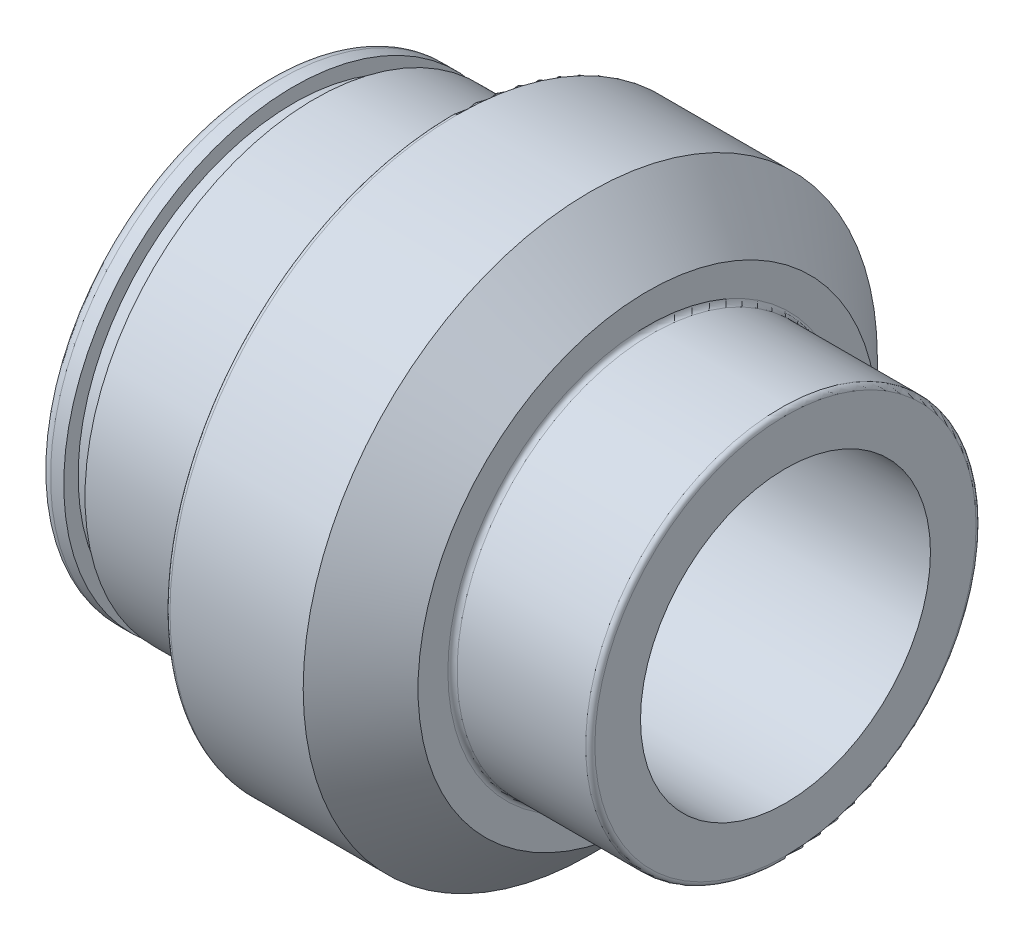
ISO-10303-21;
HEADER;
FILE_DESCRIPTION(('STEP AP214'),'2;1');
FILE_NAME('part.step','',(''),(''),'','','');
FILE_SCHEMA(('AUTOMOTIVE_DESIGN { 1 0 10303 214 1 1 1 1 }'));
ENDSEC;
DATA;
#1=APPLICATION_CONTEXT('core data for automotive mechanical design processes');
#2=APPLICATION_PROTOCOL_DEFINITION('international standard','automotive_design',2000,#1);
#3=PRODUCT_CONTEXT('',#1,'mechanical');
#4=PRODUCT('Part','Part','',(#3));
#5=PRODUCT_RELATED_PRODUCT_CATEGORY('part','',(#4));
#6=PRODUCT_DEFINITION_FORMATION('','',#4);
#7=PRODUCT_DEFINITION_CONTEXT('part definition',#1,'design');
#8=PRODUCT_DEFINITION('design','',#6,#7);
#9=PRODUCT_DEFINITION_SHAPE('','',#8);
#10=(LENGTH_UNIT() NAMED_UNIT(*) SI_UNIT(.MILLI.,.METRE.));
#11=(NAMED_UNIT(*) PLANE_ANGLE_UNIT() SI_UNIT($,.RADIAN.));
#12=(NAMED_UNIT(*) SI_UNIT($,.STERADIAN.) SOLID_ANGLE_UNIT());
#13=UNCERTAINTY_MEASURE_WITH_UNIT(LENGTH_MEASURE(1.E-05),#10,'distance_accuracy_value','');
#14=(GEOMETRIC_REPRESENTATION_CONTEXT(3) GLOBAL_UNCERTAINTY_ASSIGNED_CONTEXT((#13)) GLOBAL_UNIT_ASSIGNED_CONTEXT((#10,
#11,#12)) REPRESENTATION_CONTEXT('',''));
#15=CARTESIAN_POINT('',(0.,0.,0.));
#16=DIRECTION('',(0.,0.,1.));
#17=DIRECTION('',(1.,0.,0.));
#18=AXIS2_PLACEMENT_3D('',#15,#16,#17);
#19=CARTESIAN_POINT('',(-44.,0.,0.));
#20=DIRECTION('',(1.,0.,0.));
#21=DIRECTION('',(0.,0.,-1.));
#22=AXIS2_PLACEMENT_3D('',#19,#20,#21);
#23=TOROIDAL_SURFACE('',#22,19.,0.999999999999999);
#24=CARTESIAN_POINT('',(-45.,0.,0.));
#25=DIRECTION('',(1.,0.,0.));
#26=DIRECTION('',(0.,0.,-1.));
#27=AXIS2_PLACEMENT_3D('',#24,#25,#26);
#28=CIRCLE('',#27,19.);
#29=CARTESIAN_POINT('',(-45.,0.,-19.));
#30=VERTEX_POINT('',#29);
#31=EDGE_CURVE('E10',#30,#30,#28,.T.);
#32=ORIENTED_EDGE('',*,*,#31,.T.);
#33=EDGE_LOOP('',(#32));
#34=FACE_BOUND('',#33,.T.);
#35=CARTESIAN_POINT('',(-44.,0.,0.));
#36=DIRECTION('',(1.,0.,0.));
#37=DIRECTION('',(0.,0.,-1.));
#38=AXIS2_PLACEMENT_3D('',#35,#36,#37);
#39=CIRCLE('',#38,20.);
#40=CARTESIAN_POINT('',(-44.,0.,-20.));
#41=VERTEX_POINT('',#40);
#42=EDGE_CURVE('E107',#41,#41,#39,.T.);
#43=ORIENTED_EDGE('',*,*,#42,.F.);
#44=EDGE_LOOP('',(#43));
#45=FACE_BOUND('',#44,.T.);
#46=ADVANCED_FACE('F43',(#34,#45),#23,.T.);
#47=CARTESIAN_POINT('',(-45.,19.,0.));
#48=DIRECTION('',(-1.,0.,0.));
#49=DIRECTION('',(0.,0.,1.));
#50=AXIS2_PLACEMENT_3D('',#47,#48,#49);
#51=PLANE('',#50);
#52=CARTESIAN_POINT('',(-45.,0.,0.));
#53=DIRECTION('',(1.,0.,0.));
#54=DIRECTION('',(0.,0.,-1.));
#55=AXIS2_PLACEMENT_3D('',#52,#53,#54);
#56=CIRCLE('',#55,6.99999999999999);
#57=CARTESIAN_POINT('',(-45.,0.,-6.99999999999999));
#58=VERTEX_POINT('',#57);
#59=EDGE_CURVE('E49',#58,#58,#56,.T.);
#60=ORIENTED_EDGE('',*,*,#59,.T.);
#61=EDGE_LOOP('',(#60));
#62=FACE_BOUND('',#61,.T.);
#63=ORIENTED_EDGE('',*,*,#31,.F.);
#64=EDGE_LOOP('',(#63));
#65=FACE_BOUND('',#64,.T.);
#66=ADVANCED_FACE('F115',(#62,#65),#51,.T.);
#67=CARTESIAN_POINT('',(0.,0.,0.));
#68=DIRECTION('',(1.,0.,0.));
#69=DIRECTION('',(0.,0.,-1.));
#70=AXIS2_PLACEMENT_3D('',#67,#68,#69);
#71=CYLINDRICAL_SURFACE('',#70,7.);
#72=CARTESIAN_POINT('',(-30.2475952641916,0.,0.));
#73=DIRECTION('',(1.,0.,0.));
#74=DIRECTION('',(0.,0.,-1.));
#75=AXIS2_PLACEMENT_3D('',#72,#73,#74);
#76=CIRCLE('',#75,7.);
#77=CARTESIAN_POINT('',(-30.2475952641916,0.,-7.));
#78=VERTEX_POINT('',#77);
#79=EDGE_CURVE('E53',#78,#78,#76,.T.);
#80=ORIENTED_EDGE('',*,*,#79,.T.);
#81=EDGE_LOOP('',(#80));
#82=FACE_BOUND('',#81,.T.);
#83=ORIENTED_EDGE('',*,*,#59,.F.);
#84=EDGE_LOOP('',(#83));
#85=FACE_BOUND('',#84,.T.);
#86=ADVANCED_FACE('F119',(#82,#85),#71,.F.);
#87=CARTESIAN_POINT('',(-30.2475952641916,0.,0.));
#88=DIRECTION('',(1.,0.,0.));
#89=DIRECTION('',(0.,0.,-1.));
#90=AXIS2_PLACEMENT_3D('',#87,#88,#89);
#91=CONICAL_SURFACE('',#90,7.,1.0471975511966);
#92=CARTESIAN_POINT('',(-27.,0.,0.));
#93=DIRECTION('',(1.,0.,0.));
#94=DIRECTION('',(0.,0.,-1.));
#95=AXIS2_PLACEMENT_3D('',#92,#93,#94);
#96=CIRCLE('',#95,12.625);
#97=CARTESIAN_POINT('',(-27.,0.,-12.625));
#98=VERTEX_POINT('',#97);
#99=EDGE_CURVE('E57',#98,#98,#96,.T.);
#100=ORIENTED_EDGE('',*,*,#99,.T.);
#101=EDGE_LOOP('',(#100));
#102=FACE_BOUND('',#101,.T.);
#103=ORIENTED_EDGE('',*,*,#79,.F.);
#104=EDGE_LOOP('',(#103));
#105=FACE_BOUND('',#104,.T.);
#106=ADVANCED_FACE('F124',(#102,#105),#91,.F.);
#107=CARTESIAN_POINT('',(0.,0.,0.));
#108=DIRECTION('',(1.,0.,0.));
#109=DIRECTION('',(0.,0.,-1.));
#110=AXIS2_PLACEMENT_3D('',#107,#108,#109);
#111=CYLINDRICAL_SURFACE('',#110,12.625);
#112=CARTESIAN_POINT('',(0.,0.,0.));
#113=DIRECTION('',(1.,0.,0.));
#114=DIRECTION('',(0.,0.,-1.));
#115=AXIS2_PLACEMENT_3D('',#112,#113,#114);
#116=CIRCLE('',#115,12.625);
#117=CARTESIAN_POINT('',(0.,0.,-12.625));
#118=VERTEX_POINT('',#117);
#119=EDGE_CURVE('E62',#118,#118,#116,.T.);
#120=ORIENTED_EDGE('',*,*,#119,.T.);
#121=EDGE_LOOP('',(#120));
#122=FACE_BOUND('',#121,.T.);
#123=ORIENTED_EDGE('',*,*,#99,.F.);
#124=EDGE_LOOP('',(#123));
#125=FACE_BOUND('',#124,.T.);
#126=ADVANCED_FACE('F131',(#122,#125),#111,.F.);
#127=CARTESIAN_POINT('',(0.,12.625,0.));
#128=DIRECTION('',(1.,0.,0.));
#129=DIRECTION('',(0.,0.,-1.));
#130=AXIS2_PLACEMENT_3D('',#127,#128,#129);
#131=PLANE('',#130);
#132=CARTESIAN_POINT('',(0.,0.,0.));
#133=DIRECTION('',(1.,0.,0.));
#134=DIRECTION('',(0.,0.,-1.));
#135=AXIS2_PLACEMENT_3D('',#132,#133,#134);
#136=CIRCLE('',#135,16.6);
#137=CARTESIAN_POINT('',(0.,0.,-16.6));
#138=VERTEX_POINT('',#137);
#139=EDGE_CURVE('E65',#138,#138,#136,.T.);
#140=ORIENTED_EDGE('',*,*,#139,.T.);
#141=EDGE_LOOP('',(#140));
#142=FACE_BOUND('',#141,.T.);
#143=ORIENTED_EDGE('',*,*,#119,.F.);
#144=EDGE_LOOP('',(#143));
#145=FACE_BOUND('',#144,.T.);
#146=ADVANCED_FACE('F135',(#142,#145),#131,.T.);
#147=CARTESIAN_POINT('',(-0.4,0.,0.));
#148=DIRECTION('',(1.,0.,0.));
#149=DIRECTION('',(0.,0.,-1.));
#150=AXIS2_PLACEMENT_3D('',#147,#148,#149);
#151=TOROIDAL_SURFACE('',#150,16.6,0.400000000000002);
#152=CARTESIAN_POINT('',(-0.4,0.,0.));
#153=DIRECTION('',(1.,0.,0.));
#154=DIRECTION('',(0.,0.,-1.));
#155=AXIS2_PLACEMENT_3D('',#152,#153,#154);
#156=CIRCLE('',#155,17.);
#157=CARTESIAN_POINT('',(-0.4,0.,-17.));
#158=VERTEX_POINT('',#157);
#159=EDGE_CURVE('E68',#158,#158,#156,.T.);
#160=ORIENTED_EDGE('',*,*,#159,.T.);
#161=EDGE_LOOP('',(#160));
#162=FACE_BOUND('',#161,.T.);
#163=ORIENTED_EDGE('',*,*,#139,.F.);
#164=EDGE_LOOP('',(#163));
#165=FACE_BOUND('',#164,.T.);
#166=ADVANCED_FACE('F139',(#162,#165),#151,.T.);
#167=CARTESIAN_POINT('',(0.,0.,0.));
#168=DIRECTION('',(1.,0.,0.));
#169=DIRECTION('',(0.,0.,-1.));
#170=AXIS2_PLACEMENT_3D('',#167,#168,#169);
#171=CYLINDRICAL_SURFACE('',#170,17.);
#172=CARTESIAN_POINT('',(-11.6,0.,0.));
#173=DIRECTION('',(1.,0.,0.));
#174=DIRECTION('',(0.,0.,-1.));
#175=AXIS2_PLACEMENT_3D('',#172,#173,#174);
#176=CIRCLE('',#175,17.);
#177=CARTESIAN_POINT('',(-11.6,0.,-17.));
#178=VERTEX_POINT('',#177);
#179=EDGE_CURVE('E71',#178,#178,#176,.T.);
#180=ORIENTED_EDGE('',*,*,#179,.T.);
#181=EDGE_LOOP('',(#180));
#182=FACE_BOUND('',#181,.T.);
#183=ORIENTED_EDGE('',*,*,#159,.F.);
#184=EDGE_LOOP('',(#183));
#185=FACE_BOUND('',#184,.T.);
#186=ADVANCED_FACE('F143',(#182,#185),#171,.T.);
#187=CARTESIAN_POINT('',(-11.6,0.,0.));
#188=DIRECTION('',(1.,0.,0.));
#189=DIRECTION('',(0.,0.,-1.));
#190=AXIS2_PLACEMENT_3D('',#187,#188,#189);
#191=TOROIDAL_SURFACE('',#190,17.4,0.4);
#192=CARTESIAN_POINT('',(-12.,0.,0.));
#193=DIRECTION('',(1.,0.,0.));
#194=DIRECTION('',(0.,0.,-1.));
#195=AXIS2_PLACEMENT_3D('',#192,#193,#194);
#196=CIRCLE('',#195,17.4);
#197=CARTESIAN_POINT('',(-12.,0.,-17.4));
#198=VERTEX_POINT('',#197);
#199=EDGE_CURVE('E74',#198,#198,#196,.T.);
#200=ORIENTED_EDGE('',*,*,#199,.T.);
#201=EDGE_LOOP('',(#200));
#202=FACE_BOUND('',#201,.T.);
#203=ORIENTED_EDGE('',*,*,#179,.F.);
#204=EDGE_LOOP('',(#203));
#205=FACE_BOUND('',#204,.T.);
#206=ADVANCED_FACE('F147',(#202,#205),#191,.F.);
#207=CARTESIAN_POINT('',(-12.,17.4,0.));
#208=DIRECTION('',(1.,0.,0.));
#209=DIRECTION('',(0.,0.,-1.));
#210=AXIS2_PLACEMENT_3D('',#207,#208,#209);
#211=PLANE('',#210);
#212=CARTESIAN_POINT('',(-12.,0.,0.));
#213=DIRECTION('',(1.,0.,0.));
#214=DIRECTION('',(0.,0.,-1.));
#215=AXIS2_PLACEMENT_3D('',#212,#213,#214);
#216=CIRCLE('',#215,20.0000000000001);
#217=CARTESIAN_POINT('',(-12.,0.,-20.0000000000001));
#218=VERTEX_POINT('',#217);
#219=EDGE_CURVE('E77',#218,#218,#216,.T.);
#220=ORIENTED_EDGE('',*,*,#219,.T.);
#221=EDGE_LOOP('',(#220));
#222=FACE_BOUND('',#221,.T.);
#223=ORIENTED_EDGE('',*,*,#199,.F.);
#224=EDGE_LOOP('',(#223));
#225=FACE_BOUND('',#224,.T.);
#226=ADVANCED_FACE('F151',(#222,#225),#211,.T.);
#227=CARTESIAN_POINT('',(-12.,0.,0.));
#228=DIRECTION('',(-1.,0.,0.));
#229=DIRECTION('',(0.,0.,1.));
#230=AXIS2_PLACEMENT_3D('',#227,#228,#229);
#231=CONICAL_SURFACE('',#230,20.0000000000001,0.785398163397443);
#232=CARTESIAN_POINT('',(-17.,0.,0.));
#233=DIRECTION('',(1.,0.,0.));
#234=DIRECTION('',(0.,0.,-1.));
#235=AXIS2_PLACEMENT_3D('',#232,#233,#234);
#236=CIRCLE('',#235,25.);
#237=CARTESIAN_POINT('',(-17.,0.,-25.));
#238=VERTEX_POINT('',#237);
#239=EDGE_CURVE('E80',#238,#238,#236,.T.);
#240=ORIENTED_EDGE('',*,*,#239,.T.);
#241=EDGE_LOOP('',(#240));
#242=FACE_BOUND('',#241,.T.);
#243=ORIENTED_EDGE('',*,*,#219,.F.);
#244=EDGE_LOOP('',(#243));
#245=FACE_BOUND('',#244,.T.);
#246=ADVANCED_FACE('F155',(#242,#245),#231,.T.);
#247=CARTESIAN_POINT('',(0.,0.,0.));
#248=DIRECTION('',(1.,0.,0.));
#249=DIRECTION('',(0.,0.,-1.));
#250=AXIS2_PLACEMENT_3D('',#247,#248,#249);
#251=CYLINDRICAL_SURFACE('',#250,25.);
#252=CARTESIAN_POINT('',(-28.6,0.,0.));
#253=DIRECTION('',(1.,0.,0.));
#254=DIRECTION('',(0.,0.,-1.));
#255=AXIS2_PLACEMENT_3D('',#252,#253,#254);
#256=CIRCLE('',#255,25.);
#257=CARTESIAN_POINT('',(-28.6,0.,-25.));
#258=VERTEX_POINT('',#257);
#259=EDGE_CURVE('E83',#258,#258,#256,.T.);
#260=ORIENTED_EDGE('',*,*,#259,.T.);
#261=EDGE_LOOP('',(#260));
#262=FACE_BOUND('',#261,.T.);
#263=ORIENTED_EDGE('',*,*,#239,.F.);
#264=EDGE_LOOP('',(#263));
#265=FACE_BOUND('',#264,.T.);
#266=ADVANCED_FACE('F159',(#262,#265),#251,.T.);
#267=CARTESIAN_POINT('',(-28.6,0.,0.));
#268=DIRECTION('',(1.,0.,0.));
#269=DIRECTION('',(0.,0.,-1.));
#270=AXIS2_PLACEMENT_3D('',#267,#268,#269);
#271=TOROIDAL_SURFACE('',#270,24.6,0.400000000000001);
#272=CARTESIAN_POINT('',(-29.,0.,0.));
#273=DIRECTION('',(1.,0.,0.));
#274=DIRECTION('',(0.,0.,-1.));
#275=AXIS2_PLACEMENT_3D('',#272,#273,#274);
#276=CIRCLE('',#275,24.6);
#277=CARTESIAN_POINT('',(-29.,0.,-24.6));
#278=VERTEX_POINT('',#277);
#279=EDGE_CURVE('E86',#278,#278,#276,.T.);
#280=ORIENTED_EDGE('',*,*,#279,.T.);
#281=EDGE_LOOP('',(#280));
#282=FACE_BOUND('',#281,.T.);
#283=ORIENTED_EDGE('',*,*,#259,.F.);
#284=EDGE_LOOP('',(#283));
#285=FACE_BOUND('',#284,.T.);
#286=ADVANCED_FACE('F163',(#282,#285),#271,.T.);
#287=CARTESIAN_POINT('',(-29.,24.6,0.));
#288=DIRECTION('',(-1.,0.,0.));
#289=DIRECTION('',(0.,0.,1.));
#290=AXIS2_PLACEMENT_3D('',#287,#288,#289);
#291=PLANE('',#290);
#292=CARTESIAN_POINT('',(-29.,0.,0.));
#293=DIRECTION('',(1.,0.,0.));
#294=DIRECTION('',(0.,0.,-1.));
#295=AXIS2_PLACEMENT_3D('',#292,#293,#294);
#296=CIRCLE('',#295,20.4);
#297=CARTESIAN_POINT('',(-29.,0.,-20.4));
#298=VERTEX_POINT('',#297);
#299=EDGE_CURVE('E89',#298,#298,#296,.T.);
#300=ORIENTED_EDGE('',*,*,#299,.T.);
#301=EDGE_LOOP('',(#300));
#302=FACE_BOUND('',#301,.T.);
#303=ORIENTED_EDGE('',*,*,#279,.F.);
#304=EDGE_LOOP('',(#303));
#305=FACE_BOUND('',#304,.T.);
#306=ADVANCED_FACE('F167',(#302,#305),#291,.T.);
#307=CARTESIAN_POINT('',(-29.4,0.,0.));
#308=DIRECTION('',(1.,0.,0.));
#309=DIRECTION('',(0.,0.,-1.));
#310=AXIS2_PLACEMENT_3D('',#307,#308,#309);
#311=TOROIDAL_SURFACE('',#310,20.4,0.400000000000001);
#312=CARTESIAN_POINT('',(-29.4,0.,0.));
#313=DIRECTION('',(1.,0.,0.));
#314=DIRECTION('',(0.,0.,-1.));
#315=AXIS2_PLACEMENT_3D('',#312,#313,#314);
#316=CIRCLE('',#315,20.);
#317=CARTESIAN_POINT('',(-29.4,0.,-20.));
#318=VERTEX_POINT('',#317);
#319=EDGE_CURVE('E92',#318,#318,#316,.T.);
#320=ORIENTED_EDGE('',*,*,#319,.T.);
#321=EDGE_LOOP('',(#320));
#322=FACE_BOUND('',#321,.T.);
#323=ORIENTED_EDGE('',*,*,#299,.F.);
#324=EDGE_LOOP('',(#323));
#325=FACE_BOUND('',#324,.T.);
#326=ADVANCED_FACE('F171',(#322,#325),#311,.F.);
#327=CARTESIAN_POINT('',(0.,0.,0.));
#328=DIRECTION('',(1.,0.,0.));
#329=DIRECTION('',(0.,0.,-1.));
#330=AXIS2_PLACEMENT_3D('',#327,#328,#329);
#331=CYLINDRICAL_SURFACE('',#330,20.);
#332=CARTESIAN_POINT('',(-41.,0.,0.));
#333=DIRECTION('',(1.,0.,0.));
#334=DIRECTION('',(0.,0.,-1.));
#335=AXIS2_PLACEMENT_3D('',#332,#333,#334);
#336=CIRCLE('',#335,20.);
#337=CARTESIAN_POINT('',(-41.,0.,-20.));
#338=VERTEX_POINT('',#337);
#339=EDGE_CURVE('E95',#338,#338,#336,.T.);
#340=ORIENTED_EDGE('',*,*,#339,.T.);
#341=EDGE_LOOP('',(#340));
#342=FACE_BOUND('',#341,.T.);
#343=ORIENTED_EDGE('',*,*,#319,.F.);
#344=EDGE_LOOP('',(#343));
#345=FACE_BOUND('',#344,.T.);
#346=ADVANCED_FACE('F175',(#342,#345),#331,.T.);
#347=CARTESIAN_POINT('',(-41.,20.,0.));
#348=DIRECTION('',(-1.,0.,0.));
#349=DIRECTION('',(0.,0.,1.));
#350=AXIS2_PLACEMENT_3D('',#347,#348,#349);
#351=PLANE('',#350);
#352=CARTESIAN_POINT('',(-41.,0.,0.));
#353=DIRECTION('',(1.,0.,0.));
#354=DIRECTION('',(0.,0.,-1.));
#355=AXIS2_PLACEMENT_3D('',#352,#353,#354);
#356=CIRCLE('',#355,18.75);
#357=CARTESIAN_POINT('',(-41.,0.,-18.75));
#358=VERTEX_POINT('',#357);
#359=EDGE_CURVE('E98',#358,#358,#356,.T.);
#360=ORIENTED_EDGE('',*,*,#359,.T.);
#361=EDGE_LOOP('',(#360));
#362=FACE_BOUND('',#361,.T.);
#363=ORIENTED_EDGE('',*,*,#339,.F.);
#364=EDGE_LOOP('',(#363));
#365=FACE_BOUND('',#364,.T.);
#366=ADVANCED_FACE('F179',(#362,#365),#351,.T.);
#367=CARTESIAN_POINT('',(0.,0.,0.));
#368=DIRECTION('',(1.,0.,0.));
#369=DIRECTION('',(0.,0.,-1.));
#370=AXIS2_PLACEMENT_3D('',#367,#368,#369);
#371=CYLINDRICAL_SURFACE('',#370,18.75);
#372=CARTESIAN_POINT('',(-42.85,0.,0.));
#373=DIRECTION('',(1.,0.,0.));
#374=DIRECTION('',(0.,0.,-1.));
#375=AXIS2_PLACEMENT_3D('',#372,#373,#374);
#376=CIRCLE('',#375,18.75);
#377=CARTESIAN_POINT('',(-42.85,0.,-18.75));
#378=VERTEX_POINT('',#377);
#379=EDGE_CURVE('E101',#378,#378,#376,.T.);
#380=ORIENTED_EDGE('',*,*,#379,.T.);
#381=EDGE_LOOP('',(#380));
#382=FACE_BOUND('',#381,.T.);
#383=ORIENTED_EDGE('',*,*,#359,.F.);
#384=EDGE_LOOP('',(#383));
#385=FACE_BOUND('',#384,.T.);
#386=ADVANCED_FACE('F183',(#382,#385),#371,.T.);
#387=CARTESIAN_POINT('',(-42.85,18.75,0.));
#388=DIRECTION('',(1.,0.,0.));
#389=DIRECTION('',(0.,0.,-1.));
#390=AXIS2_PLACEMENT_3D('',#387,#388,#389);
#391=PLANE('',#390);
#392=CARTESIAN_POINT('',(-42.85,0.,0.));
#393=DIRECTION('',(1.,0.,0.));
#394=DIRECTION('',(0.,0.,-1.));
#395=AXIS2_PLACEMENT_3D('',#392,#393,#394);
#396=CIRCLE('',#395,20.);
#397=CARTESIAN_POINT('',(-42.85,0.,-20.));
#398=VERTEX_POINT('',#397);
#399=EDGE_CURVE('E104',#398,#398,#396,.T.);
#400=ORIENTED_EDGE('',*,*,#399,.T.);
#401=EDGE_LOOP('',(#400));
#402=FACE_BOUND('',#401,.T.);
#403=ORIENTED_EDGE('',*,*,#379,.F.);
#404=EDGE_LOOP('',(#403));
#405=FACE_BOUND('',#404,.T.);
#406=ADVANCED_FACE('F187',(#402,#405),#391,.T.);
#407=CARTESIAN_POINT('',(0.,0.,0.));
#408=DIRECTION('',(1.,0.,0.));
#409=DIRECTION('',(0.,0.,-1.));
#410=AXIS2_PLACEMENT_3D('',#407,#408,#409);
#411=CYLINDRICAL_SURFACE('',#410,20.);
#412=ORIENTED_EDGE('',*,*,#42,.T.);
#413=EDGE_LOOP('',(#412));
#414=FACE_BOUND('',#413,.T.);
#415=ORIENTED_EDGE('',*,*,#399,.F.);
#416=EDGE_LOOP('',(#415));
#417=FACE_BOUND('',#416,.T.);
#418=ADVANCED_FACE('F111',(#414,#417),#411,.T.);
#419=CLOSED_SHELL('',(#46,#66,#86,#106,#126,#146,#166,#186,#206,#226,#246,#266,#286,#306,#326,
#346,#366,#386,#406,#418));
#420=MANIFOLD_SOLID_BREP('B2',#419);
#421=ADVANCED_BREP_SHAPE_REPRESENTATION('',(#18,#420),#14);
#422=SHAPE_DEFINITION_REPRESENTATION(#9,#421);
ENDSEC;
END-ISO-10303-21;
